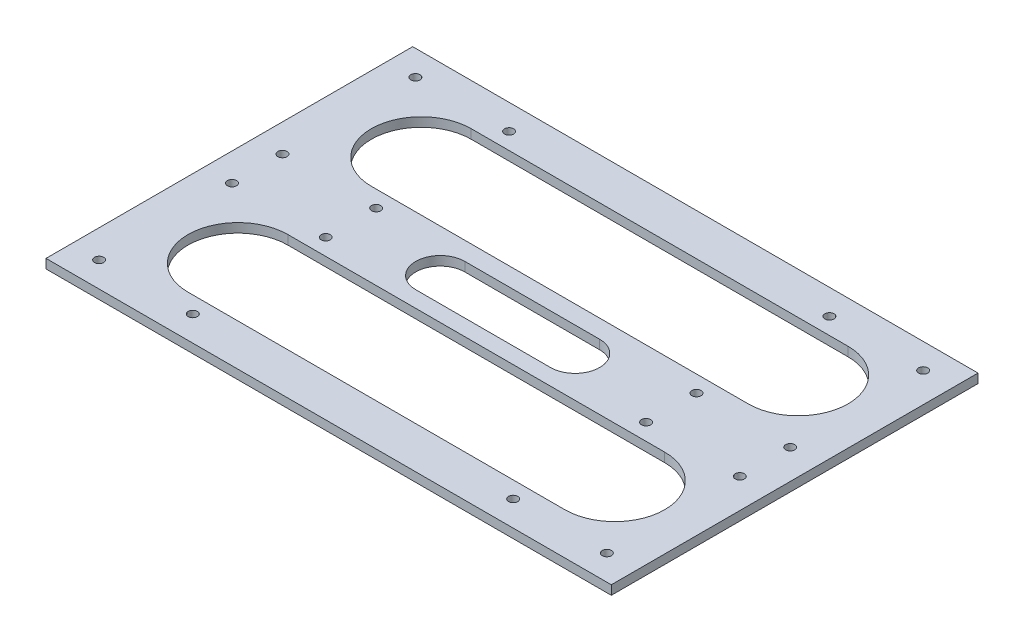
ISO-10303-21;
HEADER;
FILE_DESCRIPTION(('STEP AP214'),'2;1');
FILE_NAME('part.step','',(''),(''),'','','');
FILE_SCHEMA(('AUTOMOTIVE_DESIGN { 1 0 10303 214 1 1 1 1 }'));
ENDSEC;
DATA;
#1=APPLICATION_CONTEXT('core data for automotive mechanical design processes');
#2=APPLICATION_PROTOCOL_DEFINITION('international standard','automotive_design',2000,#1);
#3=PRODUCT_CONTEXT('',#1,'mechanical');
#4=PRODUCT('Part','Part','',(#3));
#5=PRODUCT_RELATED_PRODUCT_CATEGORY('part','',(#4));
#6=PRODUCT_DEFINITION_FORMATION('','',#4);
#7=PRODUCT_DEFINITION_CONTEXT('part definition',#1,'design');
#8=PRODUCT_DEFINITION('design','',#6,#7);
#9=PRODUCT_DEFINITION_SHAPE('','',#8);
#10=(LENGTH_UNIT() NAMED_UNIT(*) SI_UNIT(.MILLI.,.METRE.));
#11=(NAMED_UNIT(*) PLANE_ANGLE_UNIT() SI_UNIT($,.RADIAN.));
#12=(NAMED_UNIT(*) SI_UNIT($,.STERADIAN.) SOLID_ANGLE_UNIT());
#13=UNCERTAINTY_MEASURE_WITH_UNIT(LENGTH_MEASURE(1.E-05),#10,'distance_accuracy_value','');
#14=(GEOMETRIC_REPRESENTATION_CONTEXT(3) GLOBAL_UNCERTAINTY_ASSIGNED_CONTEXT((#13)) GLOBAL_UNIT_ASSIGNED_CONTEXT((#10,
#11,#12)) REPRESENTATION_CONTEXT('',''));
#15=CARTESIAN_POINT('',(0.,0.,0.));
#16=DIRECTION('',(0.,0.,1.));
#17=DIRECTION('',(1.,0.,0.));
#18=AXIS2_PLACEMENT_3D('',#15,#16,#17);
#19=CARTESIAN_POINT('',(12.2191780821921,3.,58.8493150684932));
#20=DIRECTION('',(-1.,0.,0.));
#21=DIRECTION('',(0.,0.,1.));
#22=AXIS2_PLACEMENT_3D('',#19,#20,#21);
#23=PLANE('',#22);
#24=DIRECTION('',(0.,0.,-1.));
#25=VECTOR('',#24,1.);
#26=CARTESIAN_POINT('',(12.2191780821921,0.,58.8493150684932));
#27=LINE('',#26,#25);
#28=CARTESIAN_POINT('',(12.2191780821921,0.,118.849315068493));
#29=VERTEX_POINT('',#28);
#30=CARTESIAN_POINT('',(12.2191780821921,0.,-1.15068493150684));
#31=VERTEX_POINT('',#30);
#32=EDGE_CURVE('E226',#29,#31,#27,.T.);
#33=ORIENTED_EDGE('',*,*,#32,.T.);
#34=DIRECTION('',(0.,-1.,0.));
#35=VECTOR('',#34,1.);
#36=CARTESIAN_POINT('',(12.2191780821921,3.,-1.15068493150684));
#37=LINE('',#36,#35);
#38=CARTESIAN_POINT('',(12.2191780821921,3.,-1.15068493150684));
#39=VERTEX_POINT('',#38);
#40=EDGE_CURVE('E260',#39,#31,#37,.T.);
#41=ORIENTED_EDGE('',*,*,#40,.F.);
#42=DIRECTION('',(0.,0.,-1.));
#43=VECTOR('',#42,1.);
#44=CARTESIAN_POINT('',(12.2191780821921,3.,58.8493150684932));
#45=LINE('',#44,#43);
#46=CARTESIAN_POINT('',(12.2191780821921,3.,118.849315068493));
#47=VERTEX_POINT('',#46);
#48=EDGE_CURVE('E232',#47,#39,#45,.T.);
#49=ORIENTED_EDGE('',*,*,#48,.F.);
#50=DIRECTION('',(0.,-1.,0.));
#51=VECTOR('',#50,1.);
#52=CARTESIAN_POINT('',(12.2191780821921,3.,118.849315068493));
#53=LINE('',#52,#51);
#54=EDGE_CURVE('E396',#47,#29,#53,.T.);
#55=ORIENTED_EDGE('',*,*,#54,.T.);
#56=EDGE_LOOP('',(#33,#41,#49,#55));
#57=FACE_BOUND('',#56,.T.);
#58=ADVANCED_FACE('F39',(#57),#23,.F.);
#59=CARTESIAN_POINT('',(-172.780821917808,3.,-1.15068493150684));
#60=DIRECTION('',(0.,0.,1.));
#61=DIRECTION('',(1.,0.,0.));
#62=AXIS2_PLACEMENT_3D('',#59,#60,#61);
#63=PLANE('',#62);
#64=DIRECTION('',(-1.,0.,0.));
#65=VECTOR('',#64,1.);
#66=CARTESIAN_POINT('',(-172.780821917808,0.,-1.15068493150684));
#67=LINE('',#66,#65);
#68=CARTESIAN_POINT('',(-172.780821917808,0.,-1.15068493150684));
#69=VERTEX_POINT('',#68);
#70=EDGE_CURVE('E254',#31,#69,#67,.T.);
#71=ORIENTED_EDGE('',*,*,#70,.T.);
#72=DIRECTION('',(0.,-1.,0.));
#73=VECTOR('',#72,1.);
#74=CARTESIAN_POINT('',(-172.780821917808,3.,-1.15068493150684));
#75=LINE('',#74,#73);
#76=CARTESIAN_POINT('',(-172.780821917808,3.,-1.15068493150684));
#77=VERTEX_POINT('',#76);
#78=EDGE_CURVE('E251',#77,#69,#75,.T.);
#79=ORIENTED_EDGE('',*,*,#78,.F.);
#80=DIRECTION('',(-1.,0.,0.));
#81=VECTOR('',#80,1.);
#82=CARTESIAN_POINT('',(-172.780821917808,3.,-1.15068493150684));
#83=LINE('',#82,#81);
#84=EDGE_CURVE('E244',#39,#77,#83,.T.);
#85=ORIENTED_EDGE('',*,*,#84,.F.);
#86=ORIENTED_EDGE('',*,*,#40,.T.);
#87=EDGE_LOOP('',(#71,#79,#85,#86));
#88=FACE_BOUND('',#87,.T.);
#89=ADVANCED_FACE('F493',(#88),#63,.F.);
#90=CARTESIAN_POINT('',(-172.780821917808,3.,58.8493150684932));
#91=DIRECTION('',(1.,0.,0.));
#92=DIRECTION('',(0.,0.,-1.));
#93=AXIS2_PLACEMENT_3D('',#90,#91,#92);
#94=PLANE('',#93);
#95=DIRECTION('',(0.,0.,1.));
#96=VECTOR('',#95,1.);
#97=CARTESIAN_POINT('',(-172.780821917808,0.,58.8493150684932));
#98=LINE('',#97,#96);
#99=CARTESIAN_POINT('',(-172.780821917808,0.,118.849315068493));
#100=VERTEX_POINT('',#99);
#101=EDGE_CURVE('E256',#69,#100,#98,.T.);
#102=ORIENTED_EDGE('',*,*,#101,.T.);
#103=DIRECTION('',(0.,-1.,0.));
#104=VECTOR('',#103,1.);
#105=CARTESIAN_POINT('',(-172.780821917808,3.,118.849315068493));
#106=LINE('',#105,#104);
#107=CARTESIAN_POINT('',(-172.780821917808,3.,118.849315068493));
#108=VERTEX_POINT('',#107);
#109=EDGE_CURVE('E391',#108,#100,#106,.T.);
#110=ORIENTED_EDGE('',*,*,#109,.F.);
#111=DIRECTION('',(0.,0.,1.));
#112=VECTOR('',#111,1.);
#113=CARTESIAN_POINT('',(-172.780821917808,3.,58.8493150684932));
#114=LINE('',#113,#112);
#115=EDGE_CURVE('E247',#77,#108,#114,.T.);
#116=ORIENTED_EDGE('',*,*,#115,.F.);
#117=ORIENTED_EDGE('',*,*,#78,.T.);
#118=EDGE_LOOP('',(#102,#110,#116,#117));
#119=FACE_BOUND('',#118,.T.);
#120=ADVANCED_FACE('F498',(#119),#94,.F.);
#121=CARTESIAN_POINT('',(0.,3.,0.));
#122=DIRECTION('',(0.,-1.,0.));
#123=DIRECTION('',(0.,0.,-1.));
#124=AXIS2_PLACEMENT_3D('',#121,#122,#123);
#125=PLANE('',#124);
#126=DIRECTION('',(1.,0.,0.));
#127=VECTOR('',#126,1.);
#128=CARTESIAN_POINT('',(-103.404990518041,3.,67.2281537960647));
#129=LINE('',#128,#127);
#130=CARTESIAN_POINT('',(-103.404990518041,3.,67.2281537960647));
#131=VERTEX_POINT('',#130);
#132=CARTESIAN_POINT('',(-59.2810351574963,3.,67.2281537960647));
#133=VERTEX_POINT('',#132);
#134=EDGE_CURVE('E162',#131,#133,#129,.T.);
#135=ORIENTED_EDGE('',*,*,#134,.F.);
#136=CARTESIAN_POINT('',(-103.404990518041,3.,59.2008997276366));
#137=DIRECTION('',(0.,1.,0.));
#138=DIRECTION('',(0.,0.,1.));
#139=AXIS2_PLACEMENT_3D('',#136,#137,#138);
#140=CIRCLE('',#139,8.02725406842811);
#141=CARTESIAN_POINT('',(-103.404990518041,3.,51.1736456592085));
#142=VERTEX_POINT('',#141);
#143=EDGE_CURVE('E53',#142,#131,#140,.T.);
#144=ORIENTED_EDGE('',*,*,#143,.F.);
#145=DIRECTION('',(-1.,0.,0.));
#146=VECTOR('',#145,1.);
#147=CARTESIAN_POINT('',(-103.404990518041,3.,51.1736456592085));
#148=LINE('',#147,#146);
#149=CARTESIAN_POINT('',(-59.2810351574963,3.,51.1736456592085));
#150=VERTEX_POINT('',#149);
#151=EDGE_CURVE('E170',#150,#142,#148,.T.);
#152=ORIENTED_EDGE('',*,*,#151,.F.);
#153=CARTESIAN_POINT('',(-59.2810351574963,3.,59.2008997276366));
#154=DIRECTION('',(0.,1.,0.));
#155=DIRECTION('',(0.,0.,1.));
#156=AXIS2_PLACEMENT_3D('',#153,#154,#155);
#157=CIRCLE('',#156,8.02725406842811);
#158=EDGE_CURVE('E153',#133,#150,#157,.T.);
#159=ORIENTED_EDGE('',*,*,#158,.F.);
#160=EDGE_LOOP('',(#135,#144,#152,#159));
#161=FACE_BOUND('',#160,.T.);
#162=CARTESIAN_POINT('',(-163.653280502483,3.,50.5993150684932));
#163=DIRECTION('',(0.,1.,0.));
#164=DIRECTION('',(0.,0.,1.));
#165=AXIS2_PLACEMENT_3D('',#162,#163,#164);
#166=CIRCLE('',#165,1.5);
#167=CARTESIAN_POINT('',(-163.653280502483,3.,52.0993150684932));
#168=VERTEX_POINT('',#167);
#169=EDGE_CURVE('E189',#168,#168,#166,.T.);
#170=ORIENTED_EDGE('',*,*,#169,.F.);
#171=EDGE_LOOP('',(#170));
#172=FACE_BOUND('',#171,.T.);
#173=CARTESIAN_POINT('',(-28.1532805024833,3.,50.5993150684932));
#174=DIRECTION('',(0.,1.,0.));
#175=DIRECTION('',(0.,0.,1.));
#176=AXIS2_PLACEMENT_3D('',#173,#174,#175);
#177=CIRCLE('',#176,1.5);
#178=CARTESIAN_POINT('',(-28.1532805024833,3.,52.0993150684932));
#179=VERTEX_POINT('',#178);
#180=EDGE_CURVE('E198',#179,#179,#177,.T.);
#181=ORIENTED_EDGE('',*,*,#180,.F.);
#182=EDGE_LOOP('',(#181));
#183=FACE_BOUND('',#182,.T.);
#184=CARTESIAN_POINT('',(-28.1532805024833,3.,7.09931506849316));
#185=DIRECTION('',(0.,1.,0.));
#186=DIRECTION('',(0.,0.,1.));
#187=AXIS2_PLACEMENT_3D('',#184,#185,#186);
#188=CIRCLE('',#187,1.5);
#189=CARTESIAN_POINT('',(-28.1532805024833,3.,8.59931506849316));
#190=VERTEX_POINT('',#189);
#191=EDGE_CURVE('E206',#190,#190,#188,.T.);
#192=ORIENTED_EDGE('',*,*,#191,.F.);
#193=EDGE_LOOP('',(#192));
#194=FACE_BOUND('',#193,.T.);
#195=CARTESIAN_POINT('',(-132.986057559048,3.,7.09931506849316));
#196=DIRECTION('',(0.,1.,0.));
#197=DIRECTION('',(0.,0.,1.));
#198=AXIS2_PLACEMENT_3D('',#195,#196,#197);
#199=CIRCLE('',#198,1.5);
#200=CARTESIAN_POINT('',(-132.986057559048,3.,8.59931506849316));
#201=VERTEX_POINT('',#200);
#202=EDGE_CURVE('E217',#201,#201,#199,.T.);
#203=ORIENTED_EDGE('',*,*,#202,.F.);
#204=EDGE_LOOP('',(#203));
#205=FACE_BOUND('',#204,.T.);
#206=CARTESIAN_POINT('',(-132.986057559048,3.,50.5993150684932));
#207=DIRECTION('',(0.,1.,0.));
#208=DIRECTION('',(0.,0.,1.));
#209=AXIS2_PLACEMENT_3D('',#206,#207,#208);
#210=CIRCLE('',#209,1.5);
#211=CARTESIAN_POINT('',(-132.986057559048,3.,52.0993150684932));
#212=VERTEX_POINT('',#211);
#213=EDGE_CURVE('E401',#212,#212,#210,.T.);
#214=ORIENTED_EDGE('',*,*,#213,.F.);
#215=EDGE_LOOP('',(#214));
#216=FACE_BOUND('',#215,.T.);
#217=CARTESIAN_POINT('',(2.51394244095219,3.,50.5993150684932));
#218=DIRECTION('',(0.,1.,0.));
#219=DIRECTION('',(0.,0.,1.));
#220=AXIS2_PLACEMENT_3D('',#217,#218,#219);
#221=CIRCLE('',#220,1.5);
#222=CARTESIAN_POINT('',(2.51394244095219,3.,52.0993150684932));
#223=VERTEX_POINT('',#222);
#224=EDGE_CURVE('E409',#223,#223,#221,.T.);
#225=ORIENTED_EDGE('',*,*,#224,.F.);
#226=EDGE_LOOP('',(#225));
#227=FACE_BOUND('',#226,.T.);
#228=CARTESIAN_POINT('',(2.51394244095218,3.,7.09931506849316));
#229=DIRECTION('',(0.,1.,0.));
#230=DIRECTION('',(0.,0.,1.));
#231=AXIS2_PLACEMENT_3D('',#228,#229,#230);
#232=CIRCLE('',#231,1.5);
#233=CARTESIAN_POINT('',(2.51394244095218,3.,8.59931506849316));
#234=VERTEX_POINT('',#233);
#235=EDGE_CURVE('E420',#234,#234,#232,.T.);
#236=ORIENTED_EDGE('',*,*,#235,.F.);
#237=EDGE_LOOP('',(#236));
#238=FACE_BOUND('',#237,.T.);
#239=DIRECTION('',(1.,0.,0.));
#240=VECTOR('',#239,1.);
#241=CARTESIAN_POINT('',(-139.976197672553,3.,45.1828597008955));
#242=LINE('',#241,#240);
#243=CARTESIAN_POINT('',(-139.976197672553,3.,45.1828597008955));
#244=VERTEX_POINT('',#243);
#245=CARTESIAN_POINT('',(-16.6432517297608,3.,45.1828597008955));
#246=VERTEX_POINT('',#245);
#247=EDGE_CURVE('E442',#244,#246,#242,.T.);
#248=ORIENTED_EDGE('',*,*,#247,.F.);
#249=CARTESIAN_POINT('',(-139.976197672553,3.,28.8493150684932));
#250=DIRECTION('',(0.,1.,0.));
#251=DIRECTION('',(0.,0.,1.));
#252=AXIS2_PLACEMENT_3D('',#249,#250,#251);
#253=CIRCLE('',#252,16.3335446324024);
#254=CARTESIAN_POINT('',(-139.976197672553,3.,12.5157704360908));
#255=VERTEX_POINT('',#254);
#256=EDGE_CURVE('E399',#255,#244,#253,.T.);
#257=ORIENTED_EDGE('',*,*,#256,.F.);
#258=DIRECTION('',(-1.,0.,0.));
#259=VECTOR('',#258,1.);
#260=CARTESIAN_POINT('',(-139.976197672553,3.,12.5157704360908));
#261=LINE('',#260,#259);
#262=CARTESIAN_POINT('',(-16.6432517297608,3.,12.5157704360908));
#263=VERTEX_POINT('',#262);
#264=EDGE_CURVE('E430',#263,#255,#261,.T.);
#265=ORIENTED_EDGE('',*,*,#264,.F.);
#266=CARTESIAN_POINT('',(-16.6432517297608,3.,28.8493150684932));
#267=DIRECTION('',(0.,1.,0.));
#268=DIRECTION('',(0.,0.,1.));
#269=AXIS2_PLACEMENT_3D('',#266,#267,#268);
#270=CIRCLE('',#269,16.3335446324024);
#271=EDGE_CURVE('E449',#246,#263,#270,.T.);
#272=ORIENTED_EDGE('',*,*,#271,.F.);
#273=EDGE_LOOP('',(#248,#257,#265,#272));
#274=FACE_BOUND('',#273,.T.);
#275=CARTESIAN_POINT('',(-163.653280502483,3.,7.09931506849316));
#276=DIRECTION('',(0.,1.,0.));
#277=DIRECTION('',(0.,0.,1.));
#278=AXIS2_PLACEMENT_3D('',#275,#276,#277);
#279=CIRCLE('',#278,1.5);
#280=CARTESIAN_POINT('',(-163.653280502483,3.,8.59931506849316));
#281=VERTEX_POINT('',#280);
#282=EDGE_CURVE('E227',#281,#281,#279,.T.);
#283=ORIENTED_EDGE('',*,*,#282,.F.);
#284=EDGE_LOOP('',(#283));
#285=FACE_BOUND('',#284,.T.);
#286=ORIENTED_EDGE('',*,*,#48,.T.);
#287=ORIENTED_EDGE('',*,*,#84,.T.);
#288=ORIENTED_EDGE('',*,*,#115,.T.);
#289=DIRECTION('',(-1.,0.,0.));
#290=VECTOR('',#289,1.);
#291=CARTESIAN_POINT('',(-172.780821917808,3.,118.849315068493));
#292=LINE('',#291,#290);
#293=EDGE_CURVE('E386',#47,#108,#292,.T.);
#294=ORIENTED_EDGE('',*,*,#293,.F.);
#295=EDGE_LOOP('',(#286,#287,#288,#294));
#296=FACE_BOUND('',#295,.T.);
#297=CARTESIAN_POINT('',(-163.653280502483,3.,67.0993150684932));
#298=DIRECTION('',(0.,-1.,0.));
#299=DIRECTION('',(0.,0.,-1.));
#300=AXIS2_PLACEMENT_3D('',#297,#298,#299);
#301=CIRCLE('',#300,1.5);
#302=CARTESIAN_POINT('',(-163.653280502483,3.,65.5993150684932));
#303=VERTEX_POINT('',#302);
#304=EDGE_CURVE('E351',#303,#303,#301,.T.);
#305=ORIENTED_EDGE('',*,*,#304,.T.);
#306=EDGE_LOOP('',(#305));
#307=FACE_BOUND('',#306,.T.);
#308=CARTESIAN_POINT('',(-28.1532805024833,3.,67.0993150684932));
#309=DIRECTION('',(0.,-1.,0.));
#310=DIRECTION('',(0.,0.,-1.));
#311=AXIS2_PLACEMENT_3D('',#308,#309,#310);
#312=CIRCLE('',#311,1.5);
#313=CARTESIAN_POINT('',(-28.1532805024833,3.,65.5993150684932));
#314=VERTEX_POINT('',#313);
#315=EDGE_CURVE('E362',#314,#314,#312,.T.);
#316=ORIENTED_EDGE('',*,*,#315,.T.);
#317=EDGE_LOOP('',(#316));
#318=FACE_BOUND('',#317,.T.);
#319=CARTESIAN_POINT('',(-28.1532805024833,3.,110.599315068493));
#320=DIRECTION('',(0.,-1.,0.));
#321=DIRECTION('',(0.,0.,-1.));
#322=AXIS2_PLACEMENT_3D('',#319,#320,#321);
#323=CIRCLE('',#322,1.5);
#324=CARTESIAN_POINT('',(-28.1532805024833,3.,109.099315068493));
#325=VERTEX_POINT('',#324);
#326=EDGE_CURVE('E369',#325,#325,#323,.T.);
#327=ORIENTED_EDGE('',*,*,#326,.T.);
#328=EDGE_LOOP('',(#327));
#329=FACE_BOUND('',#328,.T.);
#330=CARTESIAN_POINT('',(-132.986057559048,3.,110.599315068493));
#331=DIRECTION('',(0.,-1.,0.));
#332=DIRECTION('',(0.,0.,-1.));
#333=AXIS2_PLACEMENT_3D('',#330,#331,#332);
#334=CIRCLE('',#333,1.5);
#335=CARTESIAN_POINT('',(-132.986057559048,3.,109.099315068493));
#336=VERTEX_POINT('',#335);
#337=EDGE_CURVE('E281',#336,#336,#334,.T.);
#338=ORIENTED_EDGE('',*,*,#337,.T.);
#339=EDGE_LOOP('',(#338));
#340=FACE_BOUND('',#339,.T.);
#341=CARTESIAN_POINT('',(-132.986057559048,3.,67.0993150684932));
#342=DIRECTION('',(0.,-1.,0.));
#343=DIRECTION('',(0.,0.,-1.));
#344=AXIS2_PLACEMENT_3D('',#341,#342,#343);
#345=CIRCLE('',#344,1.5);
#346=CARTESIAN_POINT('',(-132.986057559048,3.,65.5993150684932));
#347=VERTEX_POINT('',#346);
#348=EDGE_CURVE('E282',#347,#347,#345,.T.);
#349=ORIENTED_EDGE('',*,*,#348,.T.);
#350=EDGE_LOOP('',(#349));
#351=FACE_BOUND('',#350,.T.);
#352=CARTESIAN_POINT('',(2.51394244095219,3.,67.0993150684932));
#353=DIRECTION('',(0.,-1.,0.));
#354=DIRECTION('',(0.,0.,-1.));
#355=AXIS2_PLACEMENT_3D('',#352,#353,#354);
#356=CIRCLE('',#355,1.5);
#357=CARTESIAN_POINT('',(2.51394244095219,3.,65.5993150684932));
#358=VERTEX_POINT('',#357);
#359=EDGE_CURVE('E297',#358,#358,#356,.T.);
#360=ORIENTED_EDGE('',*,*,#359,.T.);
#361=EDGE_LOOP('',(#360));
#362=FACE_BOUND('',#361,.T.);
#363=CARTESIAN_POINT('',(2.51394244095218,3.,110.599315068493));
#364=DIRECTION('',(0.,-1.,0.));
#365=DIRECTION('',(0.,0.,-1.));
#366=AXIS2_PLACEMENT_3D('',#363,#364,#365);
#367=CIRCLE('',#366,1.5);
#368=CARTESIAN_POINT('',(2.51394244095218,3.,109.099315068493));
#369=VERTEX_POINT('',#368);
#370=EDGE_CURVE('E304',#369,#369,#367,.T.);
#371=ORIENTED_EDGE('',*,*,#370,.T.);
#372=EDGE_LOOP('',(#371));
#373=FACE_BOUND('',#372,.T.);
#374=DIRECTION('',(1.,0.,0.));
#375=VECTOR('',#374,1.);
#376=CARTESIAN_POINT('',(-139.976197672553,3.,72.5157704360908));
#377=LINE('',#376,#375);
#378=CARTESIAN_POINT('',(-139.976197672553,3.,72.5157704360908));
#379=VERTEX_POINT('',#378);
#380=CARTESIAN_POINT('',(-16.6432517297608,3.,72.5157704360908));
#381=VERTEX_POINT('',#380);
#382=EDGE_CURVE('E329',#379,#381,#377,.T.);
#383=ORIENTED_EDGE('',*,*,#382,.T.);
#384=CARTESIAN_POINT('',(-16.6432517297608,3.,88.8493150684932));
#385=DIRECTION('',(0.,-1.,0.));
#386=DIRECTION('',(0.,0.,-1.));
#387=AXIS2_PLACEMENT_3D('',#384,#385,#386);
#388=CIRCLE('',#387,16.3335446324024);
#389=CARTESIAN_POINT('',(-16.6432517297608,3.,105.182859700896));
#390=VERTEX_POINT('',#389);
#391=EDGE_CURVE('E339',#381,#390,#388,.T.);
#392=ORIENTED_EDGE('',*,*,#391,.T.);
#393=DIRECTION('',(-1.,0.,0.));
#394=VECTOR('',#393,1.);
#395=CARTESIAN_POINT('',(-139.976197672553,3.,105.182859700896));
#396=LINE('',#395,#394);
#397=CARTESIAN_POINT('',(-139.976197672553,3.,105.182859700896));
#398=VERTEX_POINT('',#397);
#399=EDGE_CURVE('E314',#390,#398,#396,.T.);
#400=ORIENTED_EDGE('',*,*,#399,.T.);
#401=CARTESIAN_POINT('',(-139.976197672553,3.,88.8493150684932));
#402=DIRECTION('',(0.,-1.,0.));
#403=DIRECTION('',(0.,0.,-1.));
#404=AXIS2_PLACEMENT_3D('',#401,#402,#403);
#405=CIRCLE('',#404,16.3335446324024);
#406=EDGE_CURVE('E324',#398,#379,#405,.T.);
#407=ORIENTED_EDGE('',*,*,#406,.T.);
#408=EDGE_LOOP('',(#383,#392,#400,#407));
#409=FACE_BOUND('',#408,.T.);
#410=CARTESIAN_POINT('',(-163.653280502483,3.,110.599315068493));
#411=DIRECTION('',(0.,-1.,0.));
#412=DIRECTION('',(0.,0.,-1.));
#413=AXIS2_PLACEMENT_3D('',#410,#411,#412);
#414=CIRCLE('',#413,1.5);
#415=CARTESIAN_POINT('',(-163.653280502483,3.,109.099315068493));
#416=VERTEX_POINT('',#415);
#417=EDGE_CURVE('E350',#416,#416,#414,.T.);
#418=ORIENTED_EDGE('',*,*,#417,.T.);
#419=EDGE_LOOP('',(#418));
#420=FACE_BOUND('',#419,.T.);
#421=ADVANCED_FACE('F167',(#161,#172,#183,#194,#205,#216,#227,#238,#274,#285,#296,#307,#318,
#329,#340,#351,#362,#373,#409,#420),#125,.F.);
#422=CARTESIAN_POINT('',(0.,0.,0.));
#423=DIRECTION('',(0.,-1.,0.));
#424=DIRECTION('',(0.,0.,-1.));
#425=AXIS2_PLACEMENT_3D('',#422,#423,#424);
#426=PLANE('',#425);
#427=CARTESIAN_POINT('',(-103.404990518041,0.,59.2008997276366));
#428=DIRECTION('',(0.,-1.,0.));
#429=DIRECTION('',(0.,0.,-1.));
#430=AXIS2_PLACEMENT_3D('',#427,#428,#429);
#431=CIRCLE('',#430,8.02725406842811);
#432=CARTESIAN_POINT('',(-103.404990518041,0.,67.2281537960647));
#433=VERTEX_POINT('',#432);
#434=CARTESIAN_POINT('',(-103.404990518041,0.,51.1736456592085));
#435=VERTEX_POINT('',#434);
#436=EDGE_CURVE('E12',#433,#435,#431,.T.);
#437=ORIENTED_EDGE('',*,*,#436,.F.);
#438=DIRECTION('',(-1.,0.,0.));
#439=VECTOR('',#438,1.);
#440=CARTESIAN_POINT('',(0.,0.,67.2281537960647));
#441=LINE('',#440,#439);
#442=CARTESIAN_POINT('',(-59.2810351574963,0.,67.2281537960647));
#443=VERTEX_POINT('',#442);
#444=EDGE_CURVE('E263',#443,#433,#441,.T.);
#445=ORIENTED_EDGE('',*,*,#444,.F.);
#446=CARTESIAN_POINT('',(-59.2810351574963,0.,59.2008997276366));
#447=DIRECTION('',(0.,-1.,0.));
#448=DIRECTION('',(0.,0.,-1.));
#449=AXIS2_PLACEMENT_3D('',#446,#447,#448);
#450=CIRCLE('',#449,8.02725406842811);
#451=CARTESIAN_POINT('',(-59.2810351574963,0.,51.1736456592085));
#452=VERTEX_POINT('',#451);
#453=EDGE_CURVE('E156',#452,#443,#450,.T.);
#454=ORIENTED_EDGE('',*,*,#453,.F.);
#455=DIRECTION('',(1.,0.,0.));
#456=VECTOR('',#455,1.);
#457=CARTESIAN_POINT('',(0.,0.,51.1736456592085));
#458=LINE('',#457,#456);
#459=EDGE_CURVE('E46',#435,#452,#458,.T.);
#460=ORIENTED_EDGE('',*,*,#459,.F.);
#461=EDGE_LOOP('',(#437,#445,#454,#460));
#462=FACE_BOUND('',#461,.T.);
#463=CARTESIAN_POINT('',(-163.653280502483,0.,50.5993150684932));
#464=DIRECTION('',(0.,1.,0.));
#465=DIRECTION('',(0.,0.,1.));
#466=AXIS2_PLACEMENT_3D('',#463,#464,#465);
#467=CIRCLE('',#466,1.5);
#468=CARTESIAN_POINT('',(-163.653280502483,0.,52.0993150684932));
#469=VERTEX_POINT('',#468);
#470=EDGE_CURVE('E194',#469,#469,#467,.T.);
#471=ORIENTED_EDGE('',*,*,#470,.T.);
#472=EDGE_LOOP('',(#471));
#473=FACE_BOUND('',#472,.T.);
#474=CARTESIAN_POINT('',(-28.1532805024833,0.,50.5993150684932));
#475=DIRECTION('',(0.,1.,0.));
#476=DIRECTION('',(0.,0.,1.));
#477=AXIS2_PLACEMENT_3D('',#474,#475,#476);
#478=CIRCLE('',#477,1.5);
#479=CARTESIAN_POINT('',(-28.1532805024833,0.,52.0993150684932));
#480=VERTEX_POINT('',#479);
#481=EDGE_CURVE('E195',#480,#480,#478,.T.);
#482=ORIENTED_EDGE('',*,*,#481,.T.);
#483=EDGE_LOOP('',(#482));
#484=FACE_BOUND('',#483,.T.);
#485=CARTESIAN_POINT('',(-28.1532805024833,0.,7.09931506849316));
#486=DIRECTION('',(0.,1.,0.));
#487=DIRECTION('',(0.,0.,1.));
#488=AXIS2_PLACEMENT_3D('',#485,#486,#487);
#489=CIRCLE('',#488,1.5);
#490=CARTESIAN_POINT('',(-28.1532805024833,0.,8.59931506849316));
#491=VERTEX_POINT('',#490);
#492=EDGE_CURVE('E203',#491,#491,#489,.T.);
#493=ORIENTED_EDGE('',*,*,#492,.T.);
#494=EDGE_LOOP('',(#493));
#495=FACE_BOUND('',#494,.T.);
#496=CARTESIAN_POINT('',(-132.986057559048,0.,7.09931506849316));
#497=DIRECTION('',(0.,1.,0.));
#498=DIRECTION('',(0.,0.,1.));
#499=AXIS2_PLACEMENT_3D('',#496,#497,#498);
#500=CIRCLE('',#499,1.5);
#501=CARTESIAN_POINT('',(-132.986057559048,0.,8.59931506849316));
#502=VERTEX_POINT('',#501);
#503=EDGE_CURVE('E211',#502,#502,#500,.T.);
#504=ORIENTED_EDGE('',*,*,#503,.T.);
#505=EDGE_LOOP('',(#504));
#506=FACE_BOUND('',#505,.T.);
#507=CARTESIAN_POINT('',(-132.986057559048,0.,50.5993150684932));
#508=DIRECTION('',(0.,1.,0.));
#509=DIRECTION('',(0.,0.,1.));
#510=AXIS2_PLACEMENT_3D('',#507,#508,#509);
#511=CIRCLE('',#510,1.5);
#512=CARTESIAN_POINT('',(-132.986057559048,0.,52.0993150684932));
#513=VERTEX_POINT('',#512);
#514=EDGE_CURVE('E222',#513,#513,#511,.T.);
#515=ORIENTED_EDGE('',*,*,#514,.T.);
#516=EDGE_LOOP('',(#515));
#517=FACE_BOUND('',#516,.T.);
#518=CARTESIAN_POINT('',(2.51394244095219,0.,50.5993150684932));
#519=DIRECTION('',(0.,1.,0.));
#520=DIRECTION('',(0.,0.,1.));
#521=AXIS2_PLACEMENT_3D('',#518,#519,#520);
#522=CIRCLE('',#521,1.5);
#523=CARTESIAN_POINT('',(2.51394244095219,0.,52.0993150684932));
#524=VERTEX_POINT('',#523);
#525=EDGE_CURVE('E406',#524,#524,#522,.T.);
#526=ORIENTED_EDGE('',*,*,#525,.T.);
#527=EDGE_LOOP('',(#526));
#528=FACE_BOUND('',#527,.T.);
#529=CARTESIAN_POINT('',(2.51394244095218,0.,7.09931506849316));
#530=DIRECTION('',(0.,1.,0.));
#531=DIRECTION('',(0.,0.,1.));
#532=AXIS2_PLACEMENT_3D('',#529,#530,#531);
#533=CIRCLE('',#532,1.5);
#534=CARTESIAN_POINT('',(2.51394244095218,0.,8.59931506849316));
#535=VERTEX_POINT('',#534);
#536=EDGE_CURVE('E414',#535,#535,#533,.T.);
#537=ORIENTED_EDGE('',*,*,#536,.T.);
#538=EDGE_LOOP('',(#537));
#539=FACE_BOUND('',#538,.T.);
#540=CARTESIAN_POINT('',(-139.976197672553,0.,28.8493150684932));
#541=DIRECTION('',(0.,1.,0.));
#542=DIRECTION('',(0.,0.,1.));
#543=AXIS2_PLACEMENT_3D('',#540,#541,#542);
#544=CIRCLE('',#543,16.3335446324024);
#545=CARTESIAN_POINT('',(-139.976197672553,0.,12.5157704360908));
#546=VERTEX_POINT('',#545);
#547=CARTESIAN_POINT('',(-139.976197672553,0.,45.1828597008955));
#548=VERTEX_POINT('',#547);
#549=EDGE_CURVE('E426',#546,#548,#544,.T.);
#550=ORIENTED_EDGE('',*,*,#549,.T.);
#551=DIRECTION('',(1.,0.,0.));
#552=VECTOR('',#551,1.);
#553=CARTESIAN_POINT('',(-139.976197672553,0.,45.1828597008955));
#554=LINE('',#553,#552);
#555=CARTESIAN_POINT('',(-16.6432517297608,0.,45.1828597008955));
#556=VERTEX_POINT('',#555);
#557=EDGE_CURVE('E429',#548,#556,#554,.T.);
#558=ORIENTED_EDGE('',*,*,#557,.T.);
#559=CARTESIAN_POINT('',(-16.6432517297608,0.,28.8493150684932));
#560=DIRECTION('',(0.,1.,0.));
#561=DIRECTION('',(0.,0.,1.));
#562=AXIS2_PLACEMENT_3D('',#559,#560,#561);
#563=CIRCLE('',#562,16.3335446324024);
#564=CARTESIAN_POINT('',(-16.6432517297608,0.,12.5157704360908));
#565=VERTEX_POINT('',#564);
#566=EDGE_CURVE('E433',#556,#565,#563,.T.);
#567=ORIENTED_EDGE('',*,*,#566,.T.);
#568=DIRECTION('',(-1.,0.,0.));
#569=VECTOR('',#568,1.);
#570=CARTESIAN_POINT('',(-139.976197672553,0.,12.5157704360908));
#571=LINE('',#570,#569);
#572=EDGE_CURVE('E436',#565,#546,#571,.T.);
#573=ORIENTED_EDGE('',*,*,#572,.T.);
#574=EDGE_LOOP('',(#550,#558,#567,#573));
#575=FACE_BOUND('',#574,.T.);
#576=CARTESIAN_POINT('',(-163.653280502483,0.,7.09931506849316));
#577=DIRECTION('',(0.,1.,0.));
#578=DIRECTION('',(0.,0.,1.));
#579=AXIS2_PLACEMENT_3D('',#576,#577,#578);
#580=CIRCLE('',#579,1.5);
#581=CARTESIAN_POINT('',(-163.653280502483,0.,8.59931506849316));
#582=VERTEX_POINT('',#581);
#583=EDGE_CURVE('E223',#582,#582,#580,.T.);
#584=ORIENTED_EDGE('',*,*,#583,.T.);
#585=EDGE_LOOP('',(#584));
#586=FACE_BOUND('',#585,.T.);
#587=ORIENTED_EDGE('',*,*,#32,.F.);
#588=DIRECTION('',(-1.,0.,0.));
#589=VECTOR('',#588,1.);
#590=CARTESIAN_POINT('',(-172.780821917808,0.,118.849315068493));
#591=LINE('',#590,#589);
#592=EDGE_CURVE('E382',#29,#100,#591,.T.);
#593=ORIENTED_EDGE('',*,*,#592,.T.);
#594=ORIENTED_EDGE('',*,*,#101,.F.);
#595=ORIENTED_EDGE('',*,*,#70,.F.);
#596=EDGE_LOOP('',(#587,#593,#594,#595));
#597=FACE_BOUND('',#596,.T.);
#598=CARTESIAN_POINT('',(-163.653280502483,0.,67.0993150684932));
#599=DIRECTION('',(0.,-1.,0.));
#600=DIRECTION('',(0.,0.,-1.));
#601=AXIS2_PLACEMENT_3D('',#598,#599,#600);
#602=CIRCLE('',#601,1.5);
#603=CARTESIAN_POINT('',(-163.653280502483,0.,65.5993150684932));
#604=VERTEX_POINT('',#603);
#605=EDGE_CURVE('E347',#604,#604,#602,.T.);
#606=ORIENTED_EDGE('',*,*,#605,.F.);
#607=EDGE_LOOP('',(#606));
#608=FACE_BOUND('',#607,.T.);
#609=CARTESIAN_POINT('',(-28.1532805024833,0.,67.0993150684932));
#610=DIRECTION('',(0.,-1.,0.));
#611=DIRECTION('',(0.,0.,-1.));
#612=AXIS2_PLACEMENT_3D('',#609,#610,#611);
#613=CIRCLE('',#612,1.5);
#614=CARTESIAN_POINT('',(-28.1532805024833,0.,65.5993150684932));
#615=VERTEX_POINT('',#614);
#616=EDGE_CURVE('E356',#615,#615,#613,.T.);
#617=ORIENTED_EDGE('',*,*,#616,.F.);
#618=EDGE_LOOP('',(#617));
#619=FACE_BOUND('',#618,.T.);
#620=CARTESIAN_POINT('',(-28.1532805024833,0.,110.599315068493));
#621=DIRECTION('',(0.,-1.,0.));
#622=DIRECTION('',(0.,0.,-1.));
#623=AXIS2_PLACEMENT_3D('',#620,#621,#622);
#624=CIRCLE('',#623,1.5);
#625=CARTESIAN_POINT('',(-28.1532805024833,0.,109.099315068493));
#626=VERTEX_POINT('',#625);
#627=EDGE_CURVE('E367',#626,#626,#624,.T.);
#628=ORIENTED_EDGE('',*,*,#627,.F.);
#629=EDGE_LOOP('',(#628));
#630=FACE_BOUND('',#629,.T.);
#631=CARTESIAN_POINT('',(-132.986057559048,0.,110.599315068493));
#632=DIRECTION('',(0.,-1.,0.));
#633=DIRECTION('',(0.,0.,-1.));
#634=AXIS2_PLACEMENT_3D('',#631,#632,#633);
#635=CIRCLE('',#634,1.5);
#636=CARTESIAN_POINT('',(-132.986057559048,0.,109.099315068493));
#637=VERTEX_POINT('',#636);
#638=EDGE_CURVE('E374',#637,#637,#635,.T.);
#639=ORIENTED_EDGE('',*,*,#638,.F.);
#640=EDGE_LOOP('',(#639));
#641=FACE_BOUND('',#640,.T.);
#642=CARTESIAN_POINT('',(-132.986057559048,0.,67.0993150684932));
#643=DIRECTION('',(0.,-1.,0.));
#644=DIRECTION('',(0.,0.,-1.));
#645=AXIS2_PLACEMENT_3D('',#642,#643,#644);
#646=CIRCLE('',#645,1.5);
#647=CARTESIAN_POINT('',(-132.986057559048,0.,65.5993150684932));
#648=VERTEX_POINT('',#647);
#649=EDGE_CURVE('E278',#648,#648,#646,.T.);
#650=ORIENTED_EDGE('',*,*,#649,.F.);
#651=EDGE_LOOP('',(#650));
#652=FACE_BOUND('',#651,.T.);
#653=CARTESIAN_POINT('',(2.51394244095219,0.,67.0993150684932));
#654=DIRECTION('',(0.,-1.,0.));
#655=DIRECTION('',(0.,0.,-1.));
#656=AXIS2_PLACEMENT_3D('',#653,#654,#655);
#657=CIRCLE('',#656,1.5);
#658=CARTESIAN_POINT('',(2.51394244095219,0.,65.5993150684932));
#659=VERTEX_POINT('',#658);
#660=EDGE_CURVE('E287',#659,#659,#657,.T.);
#661=ORIENTED_EDGE('',*,*,#660,.F.);
#662=EDGE_LOOP('',(#661));
#663=FACE_BOUND('',#662,.T.);
#664=CARTESIAN_POINT('',(2.51394244095218,0.,110.599315068493));
#665=DIRECTION('',(0.,-1.,0.));
#666=DIRECTION('',(0.,0.,-1.));
#667=AXIS2_PLACEMENT_3D('',#664,#665,#666);
#668=CIRCLE('',#667,1.5);
#669=CARTESIAN_POINT('',(2.51394244095218,0.,109.099315068493));
#670=VERTEX_POINT('',#669);
#671=EDGE_CURVE('E302',#670,#670,#668,.T.);
#672=ORIENTED_EDGE('',*,*,#671,.F.);
#673=EDGE_LOOP('',(#672));
#674=FACE_BOUND('',#673,.T.);
#675=CARTESIAN_POINT('',(-139.976197672553,0.,88.8493150684932));
#676=DIRECTION('',(0.,-1.,0.));
#677=DIRECTION('',(0.,0.,-1.));
#678=AXIS2_PLACEMENT_3D('',#675,#676,#677);
#679=CIRCLE('',#678,16.3335446324024);
#680=CARTESIAN_POINT('',(-139.976197672553,0.,105.182859700896));
#681=VERTEX_POINT('',#680);
#682=CARTESIAN_POINT('',(-139.976197672553,0.,72.5157704360908));
#683=VERTEX_POINT('',#682);
#684=EDGE_CURVE('E310',#681,#683,#679,.T.);
#685=ORIENTED_EDGE('',*,*,#684,.F.);
#686=DIRECTION('',(-1.,0.,0.));
#687=VECTOR('',#686,1.);
#688=CARTESIAN_POINT('',(-139.976197672553,0.,105.182859700896));
#689=LINE('',#688,#687);
#690=CARTESIAN_POINT('',(-16.6432517297608,0.,105.182859700896));
#691=VERTEX_POINT('',#690);
#692=EDGE_CURVE('E320',#691,#681,#689,.T.);
#693=ORIENTED_EDGE('',*,*,#692,.F.);
#694=CARTESIAN_POINT('',(-16.6432517297608,0.,88.8493150684932));
#695=DIRECTION('',(0.,-1.,0.));
#696=DIRECTION('',(0.,0.,-1.));
#697=AXIS2_PLACEMENT_3D('',#694,#695,#696);
#698=CIRCLE('',#697,16.3335446324024);
#699=CARTESIAN_POINT('',(-16.6432517297608,0.,72.5157704360908));
#700=VERTEX_POINT('',#699);
#701=EDGE_CURVE('E317',#700,#691,#698,.T.);
#702=ORIENTED_EDGE('',*,*,#701,.F.);
#703=DIRECTION('',(1.,0.,0.));
#704=VECTOR('',#703,1.);
#705=CARTESIAN_POINT('',(-139.976197672553,0.,72.5157704360908));
#706=LINE('',#705,#704);
#707=EDGE_CURVE('E313',#683,#700,#706,.T.);
#708=ORIENTED_EDGE('',*,*,#707,.F.);
#709=EDGE_LOOP('',(#685,#693,#702,#708));
#710=FACE_BOUND('',#709,.T.);
#711=CARTESIAN_POINT('',(-163.653280502483,0.,110.599315068493));
#712=DIRECTION('',(0.,-1.,0.));
#713=DIRECTION('',(0.,0.,-1.));
#714=AXIS2_PLACEMENT_3D('',#711,#712,#713);
#715=CIRCLE('',#714,1.5);
#716=CARTESIAN_POINT('',(-163.653280502483,0.,109.099315068493));
#717=VERTEX_POINT('',#716);
#718=EDGE_CURVE('E380',#717,#717,#715,.T.);
#719=ORIENTED_EDGE('',*,*,#718,.F.);
#720=EDGE_LOOP('',(#719));
#721=FACE_BOUND('',#720,.T.);
#722=ADVANCED_FACE('F273',(#462,#473,#484,#495,#506,#517,#528,#539,#575,#586,#597,#608,#619,
#630,#641,#652,#663,#674,#710,#721),#426,.T.);
#723=CARTESIAN_POINT('',(-163.653280502483,0.,7.09931506849316));
#724=DIRECTION('',(0.,1.,0.));
#725=DIRECTION('',(0.,0.,1.));
#726=AXIS2_PLACEMENT_3D('',#723,#724,#725);
#727=CYLINDRICAL_SURFACE('',#726,1.5);
#728=ORIENTED_EDGE('',*,*,#583,.F.);
#729=EDGE_LOOP('',(#728));
#730=FACE_BOUND('',#729,.T.);
#731=ORIENTED_EDGE('',*,*,#282,.T.);
#732=EDGE_LOOP('',(#731));
#733=FACE_BOUND('',#732,.T.);
#734=ADVANCED_FACE('F481',(#730,#733),#727,.F.);
#735=CARTESIAN_POINT('',(-139.976197672553,0.,28.8493150684932));
#736=DIRECTION('',(0.,1.,0.));
#737=DIRECTION('',(0.,0.,1.));
#738=AXIS2_PLACEMENT_3D('',#735,#736,#737);
#739=CYLINDRICAL_SURFACE('',#738,16.3335446324024);
#740=ORIENTED_EDGE('',*,*,#256,.T.);
#741=DIRECTION('',(0.,1.,0.));
#742=VECTOR('',#741,1.);
#743=CARTESIAN_POINT('',(-139.976197672553,0.,45.1828597008955));
#744=LINE('',#743,#742);
#745=EDGE_CURVE('E439',#548,#244,#744,.T.);
#746=ORIENTED_EDGE('',*,*,#745,.F.);
#747=ORIENTED_EDGE('',*,*,#549,.F.);
#748=DIRECTION('',(0.,1.,0.));
#749=VECTOR('',#748,1.);
#750=CARTESIAN_POINT('',(-139.976197672553,0.,12.5157704360908));
#751=LINE('',#750,#749);
#752=EDGE_CURVE('E425',#546,#255,#751,.T.);
#753=ORIENTED_EDGE('',*,*,#752,.T.);
#754=EDGE_LOOP('',(#740,#746,#747,#753));
#755=FACE_BOUND('',#754,.T.);
#756=ADVANCED_FACE('F479',(#755),#739,.F.);
#757=CARTESIAN_POINT('',(-139.976197672553,0.,12.5157704360908));
#758=DIRECTION('',(0.,0.,-1.));
#759=DIRECTION('',(-1.,0.,0.));
#760=AXIS2_PLACEMENT_3D('',#757,#758,#759);
#761=PLANE('',#760);
#762=ORIENTED_EDGE('',*,*,#264,.T.);
#763=ORIENTED_EDGE('',*,*,#752,.F.);
#764=ORIENTED_EDGE('',*,*,#572,.F.);
#765=DIRECTION('',(0.,1.,0.));
#766=VECTOR('',#765,1.);
#767=CARTESIAN_POINT('',(-16.6432517297608,0.,12.5157704360908));
#768=LINE('',#767,#766);
#769=EDGE_CURVE('E452',#565,#263,#768,.T.);
#770=ORIENTED_EDGE('',*,*,#769,.T.);
#771=EDGE_LOOP('',(#762,#763,#764,#770));
#772=FACE_BOUND('',#771,.T.);
#773=ADVANCED_FACE('F476',(#772),#761,.F.);
#774=CARTESIAN_POINT('',(-16.6432517297608,0.,28.8493150684932));
#775=DIRECTION('',(0.,1.,0.));
#776=DIRECTION('',(0.,0.,1.));
#777=AXIS2_PLACEMENT_3D('',#774,#775,#776);
#778=CYLINDRICAL_SURFACE('',#777,16.3335446324024);
#779=ORIENTED_EDGE('',*,*,#271,.T.);
#780=ORIENTED_EDGE('',*,*,#769,.F.);
#781=ORIENTED_EDGE('',*,*,#566,.F.);
#782=DIRECTION('',(0.,1.,0.));
#783=VECTOR('',#782,1.);
#784=CARTESIAN_POINT('',(-16.6432517297608,0.,45.1828597008955));
#785=LINE('',#784,#783);
#786=EDGE_CURVE('E454',#556,#246,#785,.T.);
#787=ORIENTED_EDGE('',*,*,#786,.T.);
#788=EDGE_LOOP('',(#779,#780,#781,#787));
#789=FACE_BOUND('',#788,.T.);
#790=ADVANCED_FACE('F473',(#789),#778,.F.);
#791=CARTESIAN_POINT('',(-139.976197672553,0.,45.1828597008955));
#792=DIRECTION('',(0.,0.,1.));
#793=DIRECTION('',(1.,0.,0.));
#794=AXIS2_PLACEMENT_3D('',#791,#792,#793);
#795=PLANE('',#794);
#796=ORIENTED_EDGE('',*,*,#247,.T.);
#797=ORIENTED_EDGE('',*,*,#786,.F.);
#798=ORIENTED_EDGE('',*,*,#557,.F.);
#799=ORIENTED_EDGE('',*,*,#745,.T.);
#800=EDGE_LOOP('',(#796,#797,#798,#799));
#801=FACE_BOUND('',#800,.T.);
#802=ADVANCED_FACE('F460',(#801),#795,.F.);
#803=CARTESIAN_POINT('',(2.51394244095218,0.,7.09931506849316));
#804=DIRECTION('',(0.,1.,0.));
#805=DIRECTION('',(0.,0.,1.));
#806=AXIS2_PLACEMENT_3D('',#803,#804,#805);
#807=CYLINDRICAL_SURFACE('',#806,1.5);
#808=ORIENTED_EDGE('',*,*,#536,.F.);
#809=EDGE_LOOP('',(#808));
#810=FACE_BOUND('',#809,.T.);
#811=ORIENTED_EDGE('',*,*,#235,.T.);
#812=EDGE_LOOP('',(#811));
#813=FACE_BOUND('',#812,.T.);
#814=ADVANCED_FACE('F593',(#810,#813),#807,.F.);
#815=CARTESIAN_POINT('',(2.51394244095219,0.,50.5993150684932));
#816=DIRECTION('',(0.,1.,0.));
#817=DIRECTION('',(0.,0.,1.));
#818=AXIS2_PLACEMENT_3D('',#815,#816,#817);
#819=CYLINDRICAL_SURFACE('',#818,1.5);
#820=ORIENTED_EDGE('',*,*,#525,.F.);
#821=EDGE_LOOP('',(#820));
#822=FACE_BOUND('',#821,.T.);
#823=ORIENTED_EDGE('',*,*,#224,.T.);
#824=EDGE_LOOP('',(#823));
#825=FACE_BOUND('',#824,.T.);
#826=ADVANCED_FACE('F595',(#822,#825),#819,.F.);
#827=CARTESIAN_POINT('',(-132.986057559048,0.,50.5993150684932));
#828=DIRECTION('',(0.,1.,0.));
#829=DIRECTION('',(0.,0.,1.));
#830=AXIS2_PLACEMENT_3D('',#827,#828,#829);
#831=CYLINDRICAL_SURFACE('',#830,1.5);
#832=ORIENTED_EDGE('',*,*,#514,.F.);
#833=EDGE_LOOP('',(#832));
#834=FACE_BOUND('',#833,.T.);
#835=ORIENTED_EDGE('',*,*,#213,.T.);
#836=EDGE_LOOP('',(#835));
#837=FACE_BOUND('',#836,.T.);
#838=ADVANCED_FACE('F561',(#834,#837),#831,.F.);
#839=CARTESIAN_POINT('',(-132.986057559048,0.,7.09931506849316));
#840=DIRECTION('',(0.,1.,0.));
#841=DIRECTION('',(0.,0.,1.));
#842=AXIS2_PLACEMENT_3D('',#839,#840,#841);
#843=CYLINDRICAL_SURFACE('',#842,1.5);
#844=ORIENTED_EDGE('',*,*,#503,.F.);
#845=EDGE_LOOP('',(#844));
#846=FACE_BOUND('',#845,.T.);
#847=ORIENTED_EDGE('',*,*,#202,.T.);
#848=EDGE_LOOP('',(#847));
#849=FACE_BOUND('',#848,.T.);
#850=ADVANCED_FACE('F557',(#846,#849),#843,.F.);
#851=CARTESIAN_POINT('',(-28.1532805024833,0.,7.09931506849316));
#852=DIRECTION('',(0.,1.,0.));
#853=DIRECTION('',(0.,0.,1.));
#854=AXIS2_PLACEMENT_3D('',#851,#852,#853);
#855=CYLINDRICAL_SURFACE('',#854,1.5);
#856=ORIENTED_EDGE('',*,*,#492,.F.);
#857=EDGE_LOOP('',(#856));
#858=FACE_BOUND('',#857,.T.);
#859=ORIENTED_EDGE('',*,*,#191,.T.);
#860=EDGE_LOOP('',(#859));
#861=FACE_BOUND('',#860,.T.);
#862=ADVANCED_FACE('F560',(#858,#861),#855,.F.);
#863=CARTESIAN_POINT('',(-28.1532805024833,0.,50.5993150684932));
#864=DIRECTION('',(0.,1.,0.));
#865=DIRECTION('',(0.,0.,1.));
#866=AXIS2_PLACEMENT_3D('',#863,#864,#865);
#867=CYLINDRICAL_SURFACE('',#866,1.5);
#868=ORIENTED_EDGE('',*,*,#481,.F.);
#869=EDGE_LOOP('',(#868));
#870=FACE_BOUND('',#869,.T.);
#871=ORIENTED_EDGE('',*,*,#180,.T.);
#872=EDGE_LOOP('',(#871));
#873=FACE_BOUND('',#872,.T.);
#874=ADVANCED_FACE('F565',(#870,#873),#867,.F.);
#875=CARTESIAN_POINT('',(-163.653280502483,0.,50.5993150684932));
#876=DIRECTION('',(0.,1.,0.));
#877=DIRECTION('',(0.,0.,1.));
#878=AXIS2_PLACEMENT_3D('',#875,#876,#877);
#879=CYLINDRICAL_SURFACE('',#878,1.5);
#880=ORIENTED_EDGE('',*,*,#470,.F.);
#881=EDGE_LOOP('',(#880));
#882=FACE_BOUND('',#881,.T.);
#883=ORIENTED_EDGE('',*,*,#169,.T.);
#884=EDGE_LOOP('',(#883));
#885=FACE_BOUND('',#884,.T.);
#886=ADVANCED_FACE('F568',(#882,#885),#879,.F.);
#887=CARTESIAN_POINT('',(-172.780821917808,3.,118.849315068493));
#888=DIRECTION('',(0.,0.,-1.));
#889=DIRECTION('',(1.,0.,0.));
#890=AXIS2_PLACEMENT_3D('',#887,#888,#889);
#891=PLANE('',#890);
#892=ORIENTED_EDGE('',*,*,#592,.F.);
#893=ORIENTED_EDGE('',*,*,#54,.F.);
#894=ORIENTED_EDGE('',*,*,#293,.T.);
#895=ORIENTED_EDGE('',*,*,#109,.T.);
#896=EDGE_LOOP('',(#892,#893,#894,#895));
#897=FACE_BOUND('',#896,.T.);
#898=ADVANCED_FACE('F507',(#897),#891,.F.);
#899=CARTESIAN_POINT('',(-163.653280502483,0.,110.599315068493));
#900=DIRECTION('',(0.,1.,0.));
#901=DIRECTION('',(0.,0.,-1.));
#902=AXIS2_PLACEMENT_3D('',#899,#900,#901);
#903=CYLINDRICAL_SURFACE('',#902,1.5);
#904=ORIENTED_EDGE('',*,*,#718,.T.);
#905=EDGE_LOOP('',(#904));
#906=FACE_BOUND('',#905,.T.);
#907=ORIENTED_EDGE('',*,*,#417,.F.);
#908=EDGE_LOOP('',(#907));
#909=FACE_BOUND('',#908,.T.);
#910=ADVANCED_FACE('F545',(#906,#909),#903,.F.);
#911=CARTESIAN_POINT('',(-139.976197672553,0.,88.8493150684932));
#912=DIRECTION('',(0.,1.,0.));
#913=DIRECTION('',(0.,0.,-1.));
#914=AXIS2_PLACEMENT_3D('',#911,#912,#913);
#915=CYLINDRICAL_SURFACE('',#914,16.3335446324024);
#916=ORIENTED_EDGE('',*,*,#406,.F.);
#917=DIRECTION('',(0.,1.,0.));
#918=VECTOR('',#917,1.);
#919=CARTESIAN_POINT('',(-139.976197672553,0.,105.182859700896));
#920=LINE('',#919,#918);
#921=EDGE_CURVE('E309',#681,#398,#920,.T.);
#922=ORIENTED_EDGE('',*,*,#921,.F.);
#923=ORIENTED_EDGE('',*,*,#684,.T.);
#924=DIRECTION('',(0.,1.,0.));
#925=VECTOR('',#924,1.);
#926=CARTESIAN_POINT('',(-139.976197672553,0.,72.5157704360908));
#927=LINE('',#926,#925);
#928=EDGE_CURVE('E323',#683,#379,#927,.T.);
#929=ORIENTED_EDGE('',*,*,#928,.T.);
#930=EDGE_LOOP('',(#916,#922,#923,#929));
#931=FACE_BOUND('',#930,.T.);
#932=ADVANCED_FACE('F535',(#931),#915,.F.);
#933=CARTESIAN_POINT('',(-139.976197672553,0.,105.182859700896));
#934=DIRECTION('',(0.,0.,1.));
#935=DIRECTION('',(-1.,0.,0.));
#936=AXIS2_PLACEMENT_3D('',#933,#934,#935);
#937=PLANE('',#936);
#938=ORIENTED_EDGE('',*,*,#399,.F.);
#939=DIRECTION('',(0.,1.,0.));
#940=VECTOR('',#939,1.);
#941=CARTESIAN_POINT('',(-16.6432517297608,0.,105.182859700896));
#942=LINE('',#941,#940);
#943=EDGE_CURVE('E342',#691,#390,#942,.T.);
#944=ORIENTED_EDGE('',*,*,#943,.F.);
#945=ORIENTED_EDGE('',*,*,#692,.T.);
#946=ORIENTED_EDGE('',*,*,#921,.T.);
#947=EDGE_LOOP('',(#938,#944,#945,#946));
#948=FACE_BOUND('',#947,.T.);
#949=ADVANCED_FACE('F531',(#948),#937,.F.);
#950=CARTESIAN_POINT('',(-16.6432517297608,0.,88.8493150684932));
#951=DIRECTION('',(0.,1.,0.));
#952=DIRECTION('',(0.,0.,-1.));
#953=AXIS2_PLACEMENT_3D('',#950,#951,#952);
#954=CYLINDRICAL_SURFACE('',#953,16.3335446324024);
#955=ORIENTED_EDGE('',*,*,#391,.F.);
#956=DIRECTION('',(0.,1.,0.));
#957=VECTOR('',#956,1.);
#958=CARTESIAN_POINT('',(-16.6432517297608,0.,72.5157704360908));
#959=LINE('',#958,#957);
#960=EDGE_CURVE('E344',#700,#381,#959,.T.);
#961=ORIENTED_EDGE('',*,*,#960,.F.);
#962=ORIENTED_EDGE('',*,*,#701,.T.);
#963=ORIENTED_EDGE('',*,*,#943,.T.);
#964=EDGE_LOOP('',(#955,#961,#962,#963));
#965=FACE_BOUND('',#964,.T.);
#966=ADVANCED_FACE('F527',(#965),#954,.F.);
#967=CARTESIAN_POINT('',(-139.976197672553,0.,72.5157704360908));
#968=DIRECTION('',(0.,0.,-1.));
#969=DIRECTION('',(1.,0.,0.));
#970=AXIS2_PLACEMENT_3D('',#967,#968,#969);
#971=PLANE('',#970);
#972=ORIENTED_EDGE('',*,*,#382,.F.);
#973=ORIENTED_EDGE('',*,*,#928,.F.);
#974=ORIENTED_EDGE('',*,*,#707,.T.);
#975=ORIENTED_EDGE('',*,*,#960,.T.);
#976=EDGE_LOOP('',(#972,#973,#974,#975));
#977=FACE_BOUND('',#976,.T.);
#978=ADVANCED_FACE('F537',(#977),#971,.F.);
#979=CARTESIAN_POINT('',(2.51394244095218,0.,110.599315068493));
#980=DIRECTION('',(0.,1.,0.));
#981=DIRECTION('',(0.,0.,-1.));
#982=AXIS2_PLACEMENT_3D('',#979,#980,#981);
#983=CYLINDRICAL_SURFACE('',#982,1.5);
#984=ORIENTED_EDGE('',*,*,#671,.T.);
#985=EDGE_LOOP('',(#984));
#986=FACE_BOUND('',#985,.T.);
#987=ORIENTED_EDGE('',*,*,#370,.F.);
#988=EDGE_LOOP('',(#987));
#989=FACE_BOUND('',#988,.T.);
#990=ADVANCED_FACE('F732',(#986,#989),#983,.F.);
#991=CARTESIAN_POINT('',(2.51394244095219,0.,67.0993150684932));
#992=DIRECTION('',(0.,1.,0.));
#993=DIRECTION('',(0.,0.,-1.));
#994=AXIS2_PLACEMENT_3D('',#991,#992,#993);
#995=CYLINDRICAL_SURFACE('',#994,1.5);
#996=ORIENTED_EDGE('',*,*,#660,.T.);
#997=EDGE_LOOP('',(#996));
#998=FACE_BOUND('',#997,.T.);
#999=ORIENTED_EDGE('',*,*,#359,.F.);
#1000=EDGE_LOOP('',(#999));
#1001=FACE_BOUND('',#1000,.T.);
#1002=ADVANCED_FACE('F741',(#998,#1001),#995,.F.);
#1003=CARTESIAN_POINT('',(-132.986057559048,0.,67.0993150684932));
#1004=DIRECTION('',(0.,1.,0.));
#1005=DIRECTION('',(0.,0.,-1.));
#1006=AXIS2_PLACEMENT_3D('',#1003,#1004,#1005);
#1007=CYLINDRICAL_SURFACE('',#1006,1.5);
#1008=ORIENTED_EDGE('',*,*,#649,.T.);
#1009=EDGE_LOOP('',(#1008));
#1010=FACE_BOUND('',#1009,.T.);
#1011=ORIENTED_EDGE('',*,*,#348,.F.);
#1012=EDGE_LOOP('',(#1011));
#1013=FACE_BOUND('',#1012,.T.);
#1014=ADVANCED_FACE('F751',(#1010,#1013),#1007,.F.);
#1015=CARTESIAN_POINT('',(-132.986057559048,0.,110.599315068493));
#1016=DIRECTION('',(0.,1.,0.));
#1017=DIRECTION('',(0.,0.,-1.));
#1018=AXIS2_PLACEMENT_3D('',#1015,#1016,#1017);
#1019=CYLINDRICAL_SURFACE('',#1018,1.5);
#1020=ORIENTED_EDGE('',*,*,#638,.T.);
#1021=EDGE_LOOP('',(#1020));
#1022=FACE_BOUND('',#1021,.T.);
#1023=ORIENTED_EDGE('',*,*,#337,.F.);
#1024=EDGE_LOOP('',(#1023));
#1025=FACE_BOUND('',#1024,.T.);
#1026=ADVANCED_FACE('F761',(#1022,#1025),#1019,.F.);
#1027=CARTESIAN_POINT('',(-28.1532805024833,0.,110.599315068493));
#1028=DIRECTION('',(0.,1.,0.));
#1029=DIRECTION('',(0.,0.,-1.));
#1030=AXIS2_PLACEMENT_3D('',#1027,#1028,#1029);
#1031=CYLINDRICAL_SURFACE('',#1030,1.5);
#1032=ORIENTED_EDGE('',*,*,#627,.T.);
#1033=EDGE_LOOP('',(#1032));
#1034=FACE_BOUND('',#1033,.T.);
#1035=ORIENTED_EDGE('',*,*,#326,.F.);
#1036=EDGE_LOOP('',(#1035));
#1037=FACE_BOUND('',#1036,.T.);
#1038=ADVANCED_FACE('F771',(#1034,#1037),#1031,.F.);
#1039=CARTESIAN_POINT('',(-28.1532805024833,0.,67.0993150684932));
#1040=DIRECTION('',(0.,1.,0.));
#1041=DIRECTION('',(0.,0.,-1.));
#1042=AXIS2_PLACEMENT_3D('',#1039,#1040,#1041);
#1043=CYLINDRICAL_SURFACE('',#1042,1.5);
#1044=ORIENTED_EDGE('',*,*,#616,.T.);
#1045=EDGE_LOOP('',(#1044));
#1046=FACE_BOUND('',#1045,.T.);
#1047=ORIENTED_EDGE('',*,*,#315,.F.);
#1048=EDGE_LOOP('',(#1047));
#1049=FACE_BOUND('',#1048,.T.);
#1050=ADVANCED_FACE('F781',(#1046,#1049),#1043,.F.);
#1051=CARTESIAN_POINT('',(-163.653280502483,0.,67.0993150684932));
#1052=DIRECTION('',(0.,1.,0.));
#1053=DIRECTION('',(0.,0.,-1.));
#1054=AXIS2_PLACEMENT_3D('',#1051,#1052,#1053);
#1055=CYLINDRICAL_SURFACE('',#1054,1.5);
#1056=ORIENTED_EDGE('',*,*,#605,.T.);
#1057=EDGE_LOOP('',(#1056));
#1058=FACE_BOUND('',#1057,.T.);
#1059=ORIENTED_EDGE('',*,*,#304,.F.);
#1060=EDGE_LOOP('',(#1059));
#1061=FACE_BOUND('',#1060,.T.);
#1062=ADVANCED_FACE('F791',(#1058,#1061),#1055,.F.);
#1063=CARTESIAN_POINT('',(-103.404990518041,-7.,59.2008997276366));
#1064=DIRECTION('',(0.,1.,0.));
#1065=DIRECTION('',(0.,0.,1.));
#1066=AXIS2_PLACEMENT_3D('',#1063,#1064,#1065);
#1067=CYLINDRICAL_SURFACE('',#1066,8.02725406842811);
#1068=ORIENTED_EDGE('',*,*,#436,.T.);
#1069=DIRECTION('',(0.,1.,0.));
#1070=VECTOR('',#1069,1.);
#1071=CARTESIAN_POINT('',(-103.404990518041,-7.,51.1736456592085));
#1072=LINE('',#1071,#1070);
#1073=EDGE_CURVE('E269',#435,#142,#1072,.T.);
#1074=ORIENTED_EDGE('',*,*,#1073,.T.);
#1075=ORIENTED_EDGE('',*,*,#143,.T.);
#1076=DIRECTION('',(0.,1.,0.));
#1077=VECTOR('',#1076,1.);
#1078=CARTESIAN_POINT('',(-103.404990518041,-7.,67.2281537960647));
#1079=LINE('',#1078,#1077);
#1080=EDGE_CURVE('E159',#433,#131,#1079,.T.);
#1081=ORIENTED_EDGE('',*,*,#1080,.F.);
#1082=EDGE_LOOP('',(#1068,#1074,#1075,#1081));
#1083=FACE_BOUND('',#1082,.T.);
#1084=ADVANCED_FACE('F275',(#1083),#1067,.F.);
#1085=CARTESIAN_POINT('',(-103.404990518041,-7.,51.1736456592085));
#1086=DIRECTION('',(0.,0.,-1.));
#1087=DIRECTION('',(-1.,0.,0.));
#1088=AXIS2_PLACEMENT_3D('',#1085,#1086,#1087);
#1089=PLANE('',#1088);
#1090=ORIENTED_EDGE('',*,*,#459,.T.);
#1091=DIRECTION('',(0.,1.,0.));
#1092=VECTOR('',#1091,1.);
#1093=CARTESIAN_POINT('',(-59.2810351574963,-7.,51.1736456592085));
#1094=LINE('',#1093,#1092);
#1095=EDGE_CURVE('E158',#452,#150,#1094,.T.);
#1096=ORIENTED_EDGE('',*,*,#1095,.T.);
#1097=ORIENTED_EDGE('',*,*,#151,.T.);
#1098=ORIENTED_EDGE('',*,*,#1073,.F.);
#1099=EDGE_LOOP('',(#1090,#1096,#1097,#1098));
#1100=FACE_BOUND('',#1099,.T.);
#1101=ADVANCED_FACE('F268',(#1100),#1089,.F.);
#1102=CARTESIAN_POINT('',(-59.2810351574963,-7.,59.2008997276366));
#1103=DIRECTION('',(0.,1.,0.));
#1104=DIRECTION('',(0.,0.,1.));
#1105=AXIS2_PLACEMENT_3D('',#1102,#1103,#1104);
#1106=CYLINDRICAL_SURFACE('',#1105,8.02725406842811);
#1107=ORIENTED_EDGE('',*,*,#453,.T.);
#1108=DIRECTION('',(0.,1.,0.));
#1109=VECTOR('',#1108,1.);
#1110=CARTESIAN_POINT('',(-59.2810351574963,-7.,67.2281537960647));
#1111=LINE('',#1110,#1109);
#1112=EDGE_CURVE('E61',#443,#133,#1111,.T.);
#1113=ORIENTED_EDGE('',*,*,#1112,.T.);
#1114=ORIENTED_EDGE('',*,*,#158,.T.);
#1115=ORIENTED_EDGE('',*,*,#1095,.F.);
#1116=EDGE_LOOP('',(#1107,#1113,#1114,#1115));
#1117=FACE_BOUND('',#1116,.T.);
#1118=ADVANCED_FACE('F150',(#1117),#1106,.F.);
#1119=CARTESIAN_POINT('',(-103.404990518041,-7.,67.2281537960647));
#1120=DIRECTION('',(0.,0.,1.));
#1121=DIRECTION('',(1.,0.,0.));
#1122=AXIS2_PLACEMENT_3D('',#1119,#1120,#1121);
#1123=PLANE('',#1122);
#1124=ORIENTED_EDGE('',*,*,#444,.T.);
#1125=ORIENTED_EDGE('',*,*,#1080,.T.);
#1126=ORIENTED_EDGE('',*,*,#134,.T.);
#1127=ORIENTED_EDGE('',*,*,#1112,.F.);
#1128=EDGE_LOOP('',(#1124,#1125,#1126,#1127));
#1129=FACE_BOUND('',#1128,.T.);
#1130=ADVANCED_FACE('F163',(#1129),#1123,.F.);
#1131=CLOSED_SHELL('',(#58,#89,#120,#421,#722,#734,#756,#773,#790,#802,#814,#826,#838,#850,#862,
#874,#886,#898,#910,#932,#949,#966,#978,#990,#1002,#1014,#1026,#1038,#1050,#1062,#1084,#1101,
#1118,#1130));
#1132=MANIFOLD_SOLID_BREP('B2',#1131);
#1133=ADVANCED_BREP_SHAPE_REPRESENTATION('',(#18,#1132),#14);
#1134=SHAPE_DEFINITION_REPRESENTATION(#9,#1133);
ENDSEC;
END-ISO-10303-21;
